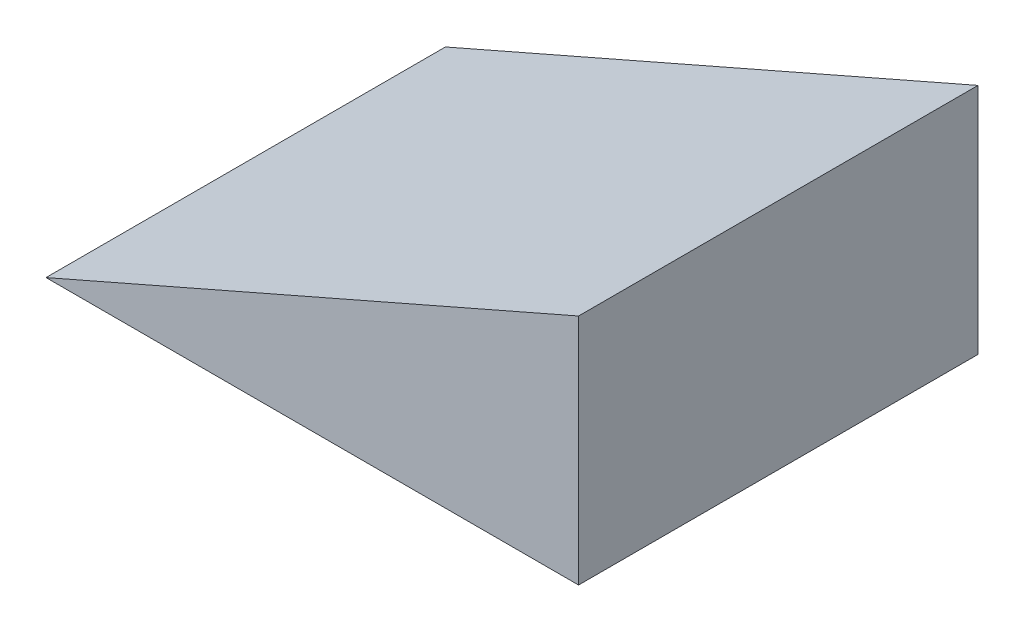
ISO-10303-21;
HEADER;
FILE_DESCRIPTION(('STEP AP214'),'2;1');
FILE_NAME('part.step','',(''),(''),'','','');
FILE_SCHEMA(('AUTOMOTIVE_DESIGN { 1 0 10303 214 1 1 1 1 }'));
ENDSEC;
DATA;
#1=APPLICATION_CONTEXT('core data for automotive mechanical design processes');
#2=APPLICATION_PROTOCOL_DEFINITION('international standard','automotive_design',2000,#1);
#3=PRODUCT_CONTEXT('',#1,'mechanical');
#4=PRODUCT('Part','Part','',(#3));
#5=PRODUCT_RELATED_PRODUCT_CATEGORY('part','',(#4));
#6=PRODUCT_DEFINITION_FORMATION('','',#4);
#7=PRODUCT_DEFINITION_CONTEXT('part definition',#1,'design');
#8=PRODUCT_DEFINITION('design','',#6,#7);
#9=PRODUCT_DEFINITION_SHAPE('','',#8);
#10=(LENGTH_UNIT() NAMED_UNIT(*) SI_UNIT(.MILLI.,.METRE.));
#11=(NAMED_UNIT(*) PLANE_ANGLE_UNIT() SI_UNIT($,.RADIAN.));
#12=(NAMED_UNIT(*) SI_UNIT($,.STERADIAN.) SOLID_ANGLE_UNIT());
#13=UNCERTAINTY_MEASURE_WITH_UNIT(LENGTH_MEASURE(1.E-05),#10,'distance_accuracy_value','');
#14=(GEOMETRIC_REPRESENTATION_CONTEXT(3) GLOBAL_UNCERTAINTY_ASSIGNED_CONTEXT((#13)) GLOBAL_UNIT_ASSIGNED_CONTEXT((#10,
#11,#12)) REPRESENTATION_CONTEXT('',''));
#15=CARTESIAN_POINT('',(0.,0.,0.));
#16=DIRECTION('',(0.,0.,1.));
#17=DIRECTION('',(1.,0.,0.));
#18=AXIS2_PLACEMENT_3D('',#15,#16,#17);
#19=CARTESIAN_POINT('',(80.,0.,60.));
#20=DIRECTION('',(0.,1.,0.));
#21=DIRECTION('',(0.,0.,1.));
#22=AXIS2_PLACEMENT_3D('',#19,#20,#21);
#23=PLANE('',#22);
#24=DIRECTION('',(1.,0.,0.));
#25=VECTOR('',#24,1.);
#26=CARTESIAN_POINT('',(80.,0.,0.));
#27=LINE('',#26,#25);
#28=CARTESIAN_POINT('',(0.,0.,0.));
#29=VERTEX_POINT('',#28);
#30=CARTESIAN_POINT('',(80.,0.,0.));
#31=VERTEX_POINT('',#30);
#32=EDGE_CURVE('E89',#29,#31,#27,.T.);
#33=ORIENTED_EDGE('',*,*,#32,.T.);
#34=DIRECTION('',(0.,0.,-1.));
#35=VECTOR('',#34,1.);
#36=CARTESIAN_POINT('',(80.,0.,60.));
#37=LINE('',#36,#35);
#38=CARTESIAN_POINT('',(80.,0.,60.));
#39=VERTEX_POINT('',#38);
#40=EDGE_CURVE('E11',#39,#31,#37,.T.);
#41=ORIENTED_EDGE('',*,*,#40,.F.);
#42=DIRECTION('',(1.,0.,0.));
#43=VECTOR('',#42,1.);
#44=CARTESIAN_POINT('',(80.,0.,60.));
#45=LINE('',#44,#43);
#46=CARTESIAN_POINT('',(0.,0.,60.));
#47=VERTEX_POINT('',#46);
#48=EDGE_CURVE('E81',#47,#39,#45,.T.);
#49=ORIENTED_EDGE('',*,*,#48,.F.);
#50=DIRECTION('',(0.,0.,-1.));
#51=VECTOR('',#50,1.);
#52=CARTESIAN_POINT('',(0.,0.,60.));
#53=LINE('',#52,#51);
#54=EDGE_CURVE('E90',#47,#29,#53,.T.);
#55=ORIENTED_EDGE('',*,*,#54,.T.);
#56=EDGE_LOOP('',(#33,#41,#49,#55));
#57=FACE_BOUND('',#56,.T.);
#58=ADVANCED_FACE('F39',(#57),#23,.F.);
#59=CARTESIAN_POINT('',(80.,35.,60.));
#60=DIRECTION('',(-1.,0.,0.));
#61=DIRECTION('',(0.,-1.,0.));
#62=AXIS2_PLACEMENT_3D('',#59,#60,#61);
#63=PLANE('',#62);
#64=DIRECTION('',(0.,1.,0.));
#65=VECTOR('',#64,1.);
#66=CARTESIAN_POINT('',(80.,35.,0.));
#67=LINE('',#66,#65);
#68=CARTESIAN_POINT('',(80.,35.,0.));
#69=VERTEX_POINT('',#68);
#70=EDGE_CURVE('E68',#31,#69,#67,.T.);
#71=ORIENTED_EDGE('',*,*,#70,.T.);
#72=DIRECTION('',(0.,0.,-1.));
#73=VECTOR('',#72,1.);
#74=CARTESIAN_POINT('',(80.,35.,60.));
#75=LINE('',#74,#73);
#76=CARTESIAN_POINT('',(80.,35.,60.));
#77=VERTEX_POINT('',#76);
#78=EDGE_CURVE('E48',#77,#69,#75,.T.);
#79=ORIENTED_EDGE('',*,*,#78,.F.);
#80=DIRECTION('',(0.,1.,0.));
#81=VECTOR('',#80,1.);
#82=CARTESIAN_POINT('',(80.,35.,60.));
#83=LINE('',#82,#81);
#84=EDGE_CURVE('E76',#39,#77,#83,.T.);
#85=ORIENTED_EDGE('',*,*,#84,.F.);
#86=ORIENTED_EDGE('',*,*,#40,.T.);
#87=EDGE_LOOP('',(#71,#79,#85,#86));
#88=FACE_BOUND('',#87,.T.);
#89=ADVANCED_FACE('F77',(#88),#63,.F.);
#90=CARTESIAN_POINT('',(0.,0.,60.));
#91=DIRECTION('',(0.400818834019708,-0.916157334902189,0.));
#92=DIRECTION('',(0.916157334902189,0.400818834019708,0.));
#93=AXIS2_PLACEMENT_3D('',#90,#91,#92);
#94=PLANE('',#93);
#95=DIRECTION('',(-0.916157334902189,-0.400818834019708,0.));
#96=VECTOR('',#95,1.);
#97=CARTESIAN_POINT('',(0.,0.,0.));
#98=LINE('',#97,#96);
#99=EDGE_CURVE('E73',#69,#29,#98,.T.);
#100=ORIENTED_EDGE('',*,*,#99,.T.);
#101=ORIENTED_EDGE('',*,*,#54,.F.);
#102=DIRECTION('',(-0.916157334902189,-0.400818834019708,0.));
#103=VECTOR('',#102,1.);
#104=CARTESIAN_POINT('',(0.,0.,60.));
#105=LINE('',#104,#103);
#106=EDGE_CURVE('E56',#77,#47,#105,.T.);
#107=ORIENTED_EDGE('',*,*,#106,.F.);
#108=ORIENTED_EDGE('',*,*,#78,.T.);
#109=EDGE_LOOP('',(#100,#101,#107,#108));
#110=FACE_BOUND('',#109,.T.);
#111=ADVANCED_FACE('F102',(#110),#94,.F.);
#112=CARTESIAN_POINT('',(0.,0.,60.));
#113=DIRECTION('',(0.,0.,1.));
#114=DIRECTION('',(1.,0.,0.));
#115=AXIS2_PLACEMENT_3D('',#112,#113,#114);
#116=PLANE('',#115);
#117=ORIENTED_EDGE('',*,*,#48,.T.);
#118=ORIENTED_EDGE('',*,*,#84,.T.);
#119=ORIENTED_EDGE('',*,*,#106,.T.);
#120=EDGE_LOOP('',(#117,#118,#119));
#121=FACE_BOUND('',#120,.T.);
#122=ADVANCED_FACE('F84',(#121),#116,.T.);
#123=CARTESIAN_POINT('',(0.,0.,0.));
#124=DIRECTION('',(0.,0.,1.));
#125=DIRECTION('',(1.,0.,0.));
#126=AXIS2_PLACEMENT_3D('',#123,#124,#125);
#127=PLANE('',#126);
#128=ORIENTED_EDGE('',*,*,#32,.F.);
#129=ORIENTED_EDGE('',*,*,#99,.F.);
#130=ORIENTED_EDGE('',*,*,#70,.F.);
#131=EDGE_LOOP('',(#128,#129,#130));
#132=FACE_BOUND('',#131,.T.);
#133=ADVANCED_FACE('F103',(#132),#127,.F.);
#134=CLOSED_SHELL('',(#58,#89,#111,#122,#133));
#135=MANIFOLD_SOLID_BREP('B2',#134);
#136=ADVANCED_BREP_SHAPE_REPRESENTATION('',(#18,#135),#14);
#137=SHAPE_DEFINITION_REPRESENTATION(#9,#136);
ENDSEC;
END-ISO-10303-21;
